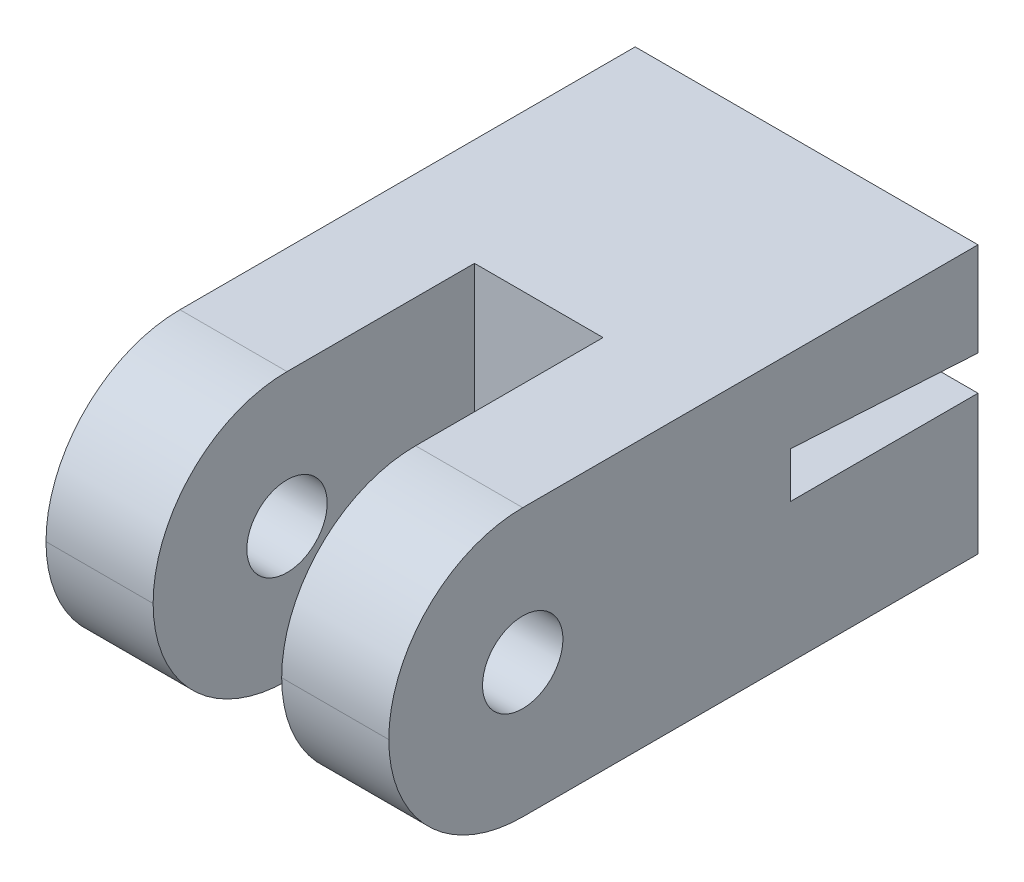
ISO-10303-21;
HEADER;
FILE_DESCRIPTION(('STEP AP214'),'2;1');
FILE_NAME('part.step','',(''),(''),'','','');
FILE_SCHEMA(('AUTOMOTIVE_DESIGN { 1 0 10303 214 1 1 1 1 }'));
ENDSEC;
DATA;
#1=APPLICATION_CONTEXT('core data for automotive mechanical design processes');
#2=APPLICATION_PROTOCOL_DEFINITION('international standard','automotive_design',2000,#1);
#3=PRODUCT_CONTEXT('',#1,'mechanical');
#4=PRODUCT('Part','Part','',(#3));
#5=PRODUCT_RELATED_PRODUCT_CATEGORY('part','',(#4));
#6=PRODUCT_DEFINITION_FORMATION('','',#4);
#7=PRODUCT_DEFINITION_CONTEXT('part definition',#1,'design');
#8=PRODUCT_DEFINITION('design','',#6,#7);
#9=PRODUCT_DEFINITION_SHAPE('','',#8);
#10=(LENGTH_UNIT() NAMED_UNIT(*) SI_UNIT(.MILLI.,.METRE.));
#11=(NAMED_UNIT(*) PLANE_ANGLE_UNIT() SI_UNIT($,.RADIAN.));
#12=(NAMED_UNIT(*) SI_UNIT($,.STERADIAN.) SOLID_ANGLE_UNIT());
#13=UNCERTAINTY_MEASURE_WITH_UNIT(LENGTH_MEASURE(1.E-05),#10,'distance_accuracy_value','');
#14=(GEOMETRIC_REPRESENTATION_CONTEXT(3) GLOBAL_UNCERTAINTY_ASSIGNED_CONTEXT((#13)) GLOBAL_UNIT_ASSIGNED_CONTEXT((#10,
#11,#12)) REPRESENTATION_CONTEXT('',''));
#15=CARTESIAN_POINT('',(0.,0.,0.));
#16=DIRECTION('',(0.,0.,1.));
#17=DIRECTION('',(1.,0.,0.));
#18=AXIS2_PLACEMENT_3D('',#15,#16,#17);
#19=CARTESIAN_POINT('',(0.,0.,10.));
#20=DIRECTION('',(0.,0.,1.));
#21=DIRECTION('',(1.,0.,0.));
#22=AXIS2_PLACEMENT_3D('',#19,#20,#21);
#23=PLANE('',#22);
#24=DIRECTION('',(1.,0.,0.));
#25=VECTOR('',#24,1.);
#26=CARTESIAN_POINT('',(0.,-4.,10.));
#27=LINE('',#26,#25);
#28=CARTESIAN_POINT('',(-2.4,-4.,10.));
#29=VERTEX_POINT('',#28);
#30=CARTESIAN_POINT('',(2.4,-4.,10.));
#31=VERTEX_POINT('',#30);
#32=EDGE_CURVE('E155',#29,#31,#27,.T.);
#33=ORIENTED_EDGE('',*,*,#32,.T.);
#34=DIRECTION('',(0.,-1.,0.));
#35=VECTOR('',#34,1.);
#36=CARTESIAN_POINT('',(2.4,-4.,10.));
#37=LINE('',#36,#35);
#38=CARTESIAN_POINT('',(2.4,6.,10.));
#39=VERTEX_POINT('',#38);
#40=EDGE_CURVE('E141',#39,#31,#37,.T.);
#41=ORIENTED_EDGE('',*,*,#40,.F.);
#42=DIRECTION('',(1.,0.,0.));
#43=VECTOR('',#42,1.);
#44=CARTESIAN_POINT('',(-6.4,6.,10.));
#45=LINE('',#44,#43);
#46=CARTESIAN_POINT('',(-2.4,6.,10.));
#47=VERTEX_POINT('',#46);
#48=EDGE_CURVE('E152',#47,#39,#45,.T.);
#49=ORIENTED_EDGE('',*,*,#48,.F.);
#50=DIRECTION('',(0.,1.,0.));
#51=VECTOR('',#50,1.);
#52=CARTESIAN_POINT('',(-2.4,-4.,10.));
#53=LINE('',#52,#51);
#54=EDGE_CURVE('E146',#29,#47,#53,.T.);
#55=ORIENTED_EDGE('',*,*,#54,.F.);
#56=EDGE_LOOP('',(#33,#41,#49,#55));
#57=FACE_BOUND('',#56,.T.);
#58=ADVANCED_FACE('F37',(#57),#23,.T.);
#59=CARTESIAN_POINT('',(-6.4,0.,10.));
#60=DIRECTION('',(1.,0.,0.));
#61=DIRECTION('',(0.,0.,-1.));
#62=AXIS2_PLACEMENT_3D('',#59,#60,#61);
#63=PLANE('',#62);
#64=CARTESIAN_POINT('',(-6.4,1.,17.));
#65=DIRECTION('',(-1.,0.,0.));
#66=DIRECTION('',(0.,0.,1.));
#67=AXIS2_PLACEMENT_3D('',#64,#65,#66);
#68=CIRCLE('',#67,1.50000000000001);
#69=CARTESIAN_POINT('',(-6.4,1.,18.5));
#70=VERTEX_POINT('',#69);
#71=EDGE_CURVE('E389',#70,#70,#68,.T.);
#72=ORIENTED_EDGE('',*,*,#71,.F.);
#73=EDGE_LOOP('',(#72));
#74=FACE_BOUND('',#73,.T.);
#75=DIRECTION('',(0.,0.,-1.));
#76=VECTOR('',#75,1.);
#77=CARTESIAN_POINT('',(-6.4,-4.,10.));
#78=LINE('',#77,#76);
#79=CARTESIAN_POINT('',(-6.4,-4.,17.));
#80=VERTEX_POINT('',#79);
#81=CARTESIAN_POINT('',(-6.4,-4.,0.));
#82=VERTEX_POINT('',#81);
#83=EDGE_CURVE('E219',#80,#82,#78,.T.);
#84=ORIENTED_EDGE('',*,*,#83,.F.);
#85=CARTESIAN_POINT('',(-6.4,1.,17.));
#86=DIRECTION('',(1.,0.,0.));
#87=DIRECTION('',(0.,0.,-1.));
#88=AXIS2_PLACEMENT_3D('',#85,#86,#87);
#89=CIRCLE('',#88,5.);
#90=CARTESIAN_POINT('',(-6.4,1.,22.));
#91=VERTEX_POINT('',#90);
#92=EDGE_CURVE('E242',#80,#91,#89,.F.);
#93=ORIENTED_EDGE('',*,*,#92,.T.);
#94=CARTESIAN_POINT('',(-6.4,1.,17.));
#95=DIRECTION('',(1.,0.,0.));
#96=DIRECTION('',(0.,0.,-1.));
#97=AXIS2_PLACEMENT_3D('',#94,#95,#96);
#98=CIRCLE('',#97,5.);
#99=CARTESIAN_POINT('',(-6.4,6.,17.));
#100=VERTEX_POINT('',#99);
#101=EDGE_CURVE('E240',#91,#100,#98,.F.);
#102=ORIENTED_EDGE('',*,*,#101,.T.);
#103=DIRECTION('',(0.,0.,1.));
#104=VECTOR('',#103,1.);
#105=CARTESIAN_POINT('',(-6.4,6.,0.));
#106=LINE('',#105,#104);
#107=CARTESIAN_POINT('',(-6.4,6.,0.));
#108=VERTEX_POINT('',#107);
#109=EDGE_CURVE('E163',#108,#100,#106,.T.);
#110=ORIENTED_EDGE('',*,*,#109,.F.);
#111=DIRECTION('',(0.,-1.,0.));
#112=VECTOR('',#111,1.);
#113=CARTESIAN_POINT('',(-6.4,0.,0.));
#114=LINE('',#113,#112);
#115=CARTESIAN_POINT('',(-6.4,2.5,0.));
#116=VERTEX_POINT('',#115);
#117=EDGE_CURVE('E208',#108,#116,#114,.T.);
#118=ORIENTED_EDGE('',*,*,#117,.T.);
#119=DIRECTION('',(0.,0.0574409581039475,0.998348905108881));
#120=VECTOR('',#119,1.);
#121=CARTESIAN_POINT('',(-6.4,3.06521251714506,9.8236400692423));
#122=LINE('',#121,#120);
#123=CARTESIAN_POINT('',(-6.4,2.90275168798205,7.));
#124=VERTEX_POINT('',#123);
#125=EDGE_CURVE('E186',#116,#124,#122,.T.);
#126=ORIENTED_EDGE('',*,*,#125,.T.);
#127=DIRECTION('',(0.,-1.,0.));
#128=VECTOR('',#127,1.);
#129=CARTESIAN_POINT('',(-6.4,0.,7.));
#130=LINE('',#129,#128);
#131=CARTESIAN_POINT('',(-6.4,1.2,7.));
#132=VERTEX_POINT('',#131);
#133=EDGE_CURVE('E190',#124,#132,#130,.T.);
#134=ORIENTED_EDGE('',*,*,#133,.T.);
#135=DIRECTION('',(0.,0.,-1.));
#136=VECTOR('',#135,1.);
#137=CARTESIAN_POINT('',(-6.4,1.2,7.));
#138=LINE('',#137,#136);
#139=CARTESIAN_POINT('',(-6.4,1.2,0.));
#140=VERTEX_POINT('',#139);
#141=EDGE_CURVE('E203',#132,#140,#138,.T.);
#142=ORIENTED_EDGE('',*,*,#141,.T.);
#143=EDGE_CURVE('E205',#140,#82,#114,.T.);
#144=ORIENTED_EDGE('',*,*,#143,.T.);
#145=EDGE_LOOP('',(#84,#93,#102,#110,#118,#126,#134,#142,#144));
#146=FACE_BOUND('',#145,.T.);
#147=ADVANCED_FACE('F284',(#74,#146),#63,.F.);
#148=CARTESIAN_POINT('',(6.4,0.,10.));
#149=DIRECTION('',(-1.,0.,0.));
#150=DIRECTION('',(0.,0.,1.));
#151=AXIS2_PLACEMENT_3D('',#148,#149,#150);
#152=PLANE('',#151);
#153=CARTESIAN_POINT('',(6.4,1.,17.));
#154=DIRECTION('',(-1.,0.,0.));
#155=DIRECTION('',(0.,0.,1.));
#156=AXIS2_PLACEMENT_3D('',#153,#154,#155);
#157=CIRCLE('',#156,1.50000000000001);
#158=CARTESIAN_POINT('',(6.4,1.,18.5));
#159=VERTEX_POINT('',#158);
#160=EDGE_CURVE('E259',#159,#159,#157,.T.);
#161=ORIENTED_EDGE('',*,*,#160,.T.);
#162=EDGE_LOOP('',(#161));
#163=FACE_BOUND('',#162,.T.);
#164=CARTESIAN_POINT('',(6.4,1.,17.));
#165=DIRECTION('',(-1.,0.,0.));
#166=DIRECTION('',(0.,0.,1.));
#167=AXIS2_PLACEMENT_3D('',#164,#165,#166);
#168=CIRCLE('',#167,5.);
#169=CARTESIAN_POINT('',(6.4,6.,17.));
#170=VERTEX_POINT('',#169);
#171=CARTESIAN_POINT('',(6.4,1.,22.));
#172=VERTEX_POINT('',#171);
#173=EDGE_CURVE('E60',#170,#172,#168,.F.);
#174=ORIENTED_EDGE('',*,*,#173,.T.);
#175=CARTESIAN_POINT('',(6.4,1.,17.));
#176=DIRECTION('',(-1.,0.,0.));
#177=DIRECTION('',(0.,0.,1.));
#178=AXIS2_PLACEMENT_3D('',#175,#176,#177);
#179=CIRCLE('',#178,5.);
#180=CARTESIAN_POINT('',(6.4,-4.,17.));
#181=VERTEX_POINT('',#180);
#182=EDGE_CURVE('E249',#172,#181,#179,.F.);
#183=ORIENTED_EDGE('',*,*,#182,.T.);
#184=DIRECTION('',(0.,0.,-1.));
#185=VECTOR('',#184,1.);
#186=CARTESIAN_POINT('',(6.4,-4.,10.));
#187=LINE('',#186,#185);
#188=CARTESIAN_POINT('',(6.4,-4.,0.));
#189=VERTEX_POINT('',#188);
#190=EDGE_CURVE('E218',#181,#189,#187,.T.);
#191=ORIENTED_EDGE('',*,*,#190,.T.);
#192=DIRECTION('',(0.,1.,0.));
#193=VECTOR('',#192,1.);
#194=CARTESIAN_POINT('',(6.4,0.,0.));
#195=LINE('',#194,#193);
#196=CARTESIAN_POINT('',(6.4,1.2,0.));
#197=VERTEX_POINT('',#196);
#198=EDGE_CURVE('E215',#189,#197,#195,.T.);
#199=ORIENTED_EDGE('',*,*,#198,.T.);
#200=DIRECTION('',(0.,0.,-1.));
#201=VECTOR('',#200,1.);
#202=CARTESIAN_POINT('',(6.4,1.2,7.));
#203=LINE('',#202,#201);
#204=CARTESIAN_POINT('',(6.4,1.2,7.));
#205=VERTEX_POINT('',#204);
#206=EDGE_CURVE('E198',#205,#197,#203,.T.);
#207=ORIENTED_EDGE('',*,*,#206,.F.);
#208=DIRECTION('',(0.,1.,0.));
#209=VECTOR('',#208,1.);
#210=CARTESIAN_POINT('',(6.4,0.,7.));
#211=LINE('',#210,#209);
#212=CARTESIAN_POINT('',(6.4,2.90275168798205,7.));
#213=VERTEX_POINT('',#212);
#214=EDGE_CURVE('E196',#205,#213,#211,.T.);
#215=ORIENTED_EDGE('',*,*,#214,.T.);
#216=DIRECTION('',(0.,0.0574409581039475,0.998348905108881));
#217=VECTOR('',#216,1.);
#218=CARTESIAN_POINT('',(6.4,2.5,0.));
#219=LINE('',#218,#217);
#220=CARTESIAN_POINT('',(6.4,2.5,0.));
#221=VERTEX_POINT('',#220);
#222=EDGE_CURVE('E180',#221,#213,#219,.T.);
#223=ORIENTED_EDGE('',*,*,#222,.F.);
#224=CARTESIAN_POINT('',(6.4,6.,0.));
#225=VERTEX_POINT('',#224);
#226=EDGE_CURVE('E214',#221,#225,#195,.T.);
#227=ORIENTED_EDGE('',*,*,#226,.T.);
#228=DIRECTION('',(0.,0.,-1.));
#229=VECTOR('',#228,1.);
#230=CARTESIAN_POINT('',(6.4,6.,0.));
#231=LINE('',#230,#229);
#232=EDGE_CURVE('E162',#170,#225,#231,.T.);
#233=ORIENTED_EDGE('',*,*,#232,.F.);
#234=EDGE_LOOP('',(#174,#183,#191,#199,#207,#215,#223,#227,#233));
#235=FACE_BOUND('',#234,.T.);
#236=ADVANCED_FACE('F273',(#163,#235),#152,.F.);
#237=CARTESIAN_POINT('',(0.,0.,0.));
#238=DIRECTION('',(0.,0.,1.));
#239=DIRECTION('',(1.,0.,0.));
#240=AXIS2_PLACEMENT_3D('',#237,#238,#239);
#241=PLANE('',#240);
#242=DIRECTION('',(1.,0.,0.));
#243=VECTOR('',#242,1.);
#244=CARTESIAN_POINT('',(0.,1.2,0.));
#245=LINE('',#244,#243);
#246=EDGE_CURVE('E189',#140,#197,#245,.T.);
#247=ORIENTED_EDGE('',*,*,#246,.T.);
#248=ORIENTED_EDGE('',*,*,#198,.F.);
#249=DIRECTION('',(1.,0.,0.));
#250=VECTOR('',#249,1.);
#251=CARTESIAN_POINT('',(0.,-4.,0.));
#252=LINE('',#251,#250);
#253=EDGE_CURVE('E211',#82,#189,#252,.T.);
#254=ORIENTED_EDGE('',*,*,#253,.F.);
#255=ORIENTED_EDGE('',*,*,#143,.F.);
#256=EDGE_LOOP('',(#247,#248,#254,#255));
#257=FACE_BOUND('',#256,.T.);
#258=ADVANCED_FACE('F279',(#257),#241,.F.);
#259=CARTESIAN_POINT('',(0.,-4.,10.));
#260=DIRECTION('',(0.,1.,0.));
#261=DIRECTION('',(0.,0.,1.));
#262=AXIS2_PLACEMENT_3D('',#259,#260,#261);
#263=PLANE('',#262);
#264=DIRECTION('',(0.,0.,-1.));
#265=VECTOR('',#264,1.);
#266=CARTESIAN_POINT('',(-2.4,-4.,22.));
#267=LINE('',#266,#265);
#268=CARTESIAN_POINT('',(-2.4,-4.,17.));
#269=VERTEX_POINT('',#268);
#270=EDGE_CURVE('E167',#269,#29,#267,.T.);
#271=ORIENTED_EDGE('',*,*,#270,.F.);
#272=DIRECTION('',(1.,0.,0.));
#273=VECTOR('',#272,1.);
#274=CARTESIAN_POINT('',(0.,-4.,17.));
#275=LINE('',#274,#273);
#276=EDGE_CURVE('E238',#269,#80,#275,.F.);
#277=ORIENTED_EDGE('',*,*,#276,.T.);
#278=ORIENTED_EDGE('',*,*,#83,.T.);
#279=ORIENTED_EDGE('',*,*,#253,.T.);
#280=ORIENTED_EDGE('',*,*,#190,.F.);
#281=DIRECTION('',(1.,0.,0.));
#282=VECTOR('',#281,1.);
#283=CARTESIAN_POINT('',(2.4,-4.,17.));
#284=LINE('',#283,#282);
#285=CARTESIAN_POINT('',(2.4,-4.,17.));
#286=VERTEX_POINT('',#285);
#287=EDGE_CURVE('E230',#181,#286,#284,.F.);
#288=ORIENTED_EDGE('',*,*,#287,.T.);
#289=DIRECTION('',(0.,0.,-1.));
#290=VECTOR('',#289,1.);
#291=CARTESIAN_POINT('',(2.4,-4.,22.));
#292=LINE('',#291,#290);
#293=EDGE_CURVE('E147',#286,#31,#292,.T.);
#294=ORIENTED_EDGE('',*,*,#293,.T.);
#295=ORIENTED_EDGE('',*,*,#32,.F.);
#296=EDGE_LOOP('',(#271,#277,#278,#279,#280,#288,#294,#295));
#297=FACE_BOUND('',#296,.T.);
#298=ADVANCED_FACE('F269',(#297),#263,.F.);
#299=ORIENTED_EDGE('',*,*,#226,.F.);
#300=DIRECTION('',(1.,0.,0.));
#301=VECTOR('',#300,1.);
#302=CARTESIAN_POINT('',(0.,2.5,0.));
#303=LINE('',#302,#301);
#304=EDGE_CURVE('E194',#116,#221,#303,.T.);
#305=ORIENTED_EDGE('',*,*,#304,.F.);
#306=ORIENTED_EDGE('',*,*,#117,.F.);
#307=DIRECTION('',(-1.,0.,0.));
#308=VECTOR('',#307,1.);
#309=CARTESIAN_POINT('',(-6.4,6.,0.));
#310=LINE('',#309,#308);
#311=EDGE_CURVE('E165',#225,#108,#310,.T.);
#312=ORIENTED_EDGE('',*,*,#311,.F.);
#313=EDGE_LOOP('',(#299,#305,#306,#312));
#314=FACE_BOUND('',#313,.T.);
#315=ADVANCED_FACE('F297',(#314),#241,.F.);
#316=CARTESIAN_POINT('',(0.,1.2,7.));
#317=DIRECTION('',(0.,1.,0.));
#318=DIRECTION('',(0.,0.,1.));
#319=AXIS2_PLACEMENT_3D('',#316,#317,#318);
#320=PLANE('',#319);
#321=ORIENTED_EDGE('',*,*,#246,.F.);
#322=ORIENTED_EDGE('',*,*,#141,.F.);
#323=DIRECTION('',(1.,0.,0.));
#324=VECTOR('',#323,1.);
#325=CARTESIAN_POINT('',(0.,1.2,7.));
#326=LINE('',#325,#324);
#327=EDGE_CURVE('E193',#132,#205,#326,.T.);
#328=ORIENTED_EDGE('',*,*,#327,.T.);
#329=ORIENTED_EDGE('',*,*,#206,.T.);
#330=EDGE_LOOP('',(#321,#322,#328,#329));
#331=FACE_BOUND('',#330,.T.);
#332=ADVANCED_FACE('F282',(#331),#320,.T.);
#333=CARTESIAN_POINT('',(0.,0.,7.));
#334=DIRECTION('',(0.,0.,1.));
#335=DIRECTION('',(1.,0.,0.));
#336=AXIS2_PLACEMENT_3D('',#333,#334,#335);
#337=PLANE('',#336);
#338=ORIENTED_EDGE('',*,*,#133,.F.);
#339=DIRECTION('',(1.,0.,0.));
#340=VECTOR('',#339,1.);
#341=CARTESIAN_POINT('',(-8.6,2.90275168798205,7.));
#342=LINE('',#341,#340);
#343=EDGE_CURVE('E183',#124,#213,#342,.T.);
#344=ORIENTED_EDGE('',*,*,#343,.T.);
#345=ORIENTED_EDGE('',*,*,#214,.F.);
#346=ORIENTED_EDGE('',*,*,#327,.F.);
#347=EDGE_LOOP('',(#338,#344,#345,#346));
#348=FACE_BOUND('',#347,.T.);
#349=ADVANCED_FACE('F287',(#348),#337,.F.);
#350=CARTESIAN_POINT('',(-8.6,2.5,0.));
#351=DIRECTION('',(0.,0.998348905108881,-0.0574409581039475));
#352=DIRECTION('',(0.,0.0574409581039475,0.998348905108881));
#353=AXIS2_PLACEMENT_3D('',#350,#351,#352);
#354=PLANE('',#353);
#355=ORIENTED_EDGE('',*,*,#304,.T.);
#356=ORIENTED_EDGE('',*,*,#222,.T.);
#357=ORIENTED_EDGE('',*,*,#343,.F.);
#358=ORIENTED_EDGE('',*,*,#125,.F.);
#359=EDGE_LOOP('',(#355,#356,#357,#358));
#360=FACE_BOUND('',#359,.T.);
#361=ADVANCED_FACE('F290',(#360),#354,.F.);
#362=CARTESIAN_POINT('',(0.,6.,0.));
#363=DIRECTION('',(0.,1.,0.));
#364=DIRECTION('',(0.,0.,1.));
#365=AXIS2_PLACEMENT_3D('',#362,#363,#364);
#366=PLANE('',#365);
#367=ORIENTED_EDGE('',*,*,#109,.T.);
#368=DIRECTION('',(-1.,0.,0.));
#369=VECTOR('',#368,1.);
#370=CARTESIAN_POINT('',(-2.4,6.,17.));
#371=LINE('',#370,#369);
#372=CARTESIAN_POINT('',(-2.4,6.,17.));
#373=VERTEX_POINT('',#372);
#374=EDGE_CURVE('E246',#100,#373,#371,.F.);
#375=ORIENTED_EDGE('',*,*,#374,.T.);
#376=DIRECTION('',(0.,0.,-1.));
#377=VECTOR('',#376,1.);
#378=CARTESIAN_POINT('',(-2.4,6.,22.));
#379=LINE('',#378,#377);
#380=EDGE_CURVE('E161',#373,#47,#379,.T.);
#381=ORIENTED_EDGE('',*,*,#380,.T.);
#382=ORIENTED_EDGE('',*,*,#48,.T.);
#383=DIRECTION('',(0.,0.,-1.));
#384=VECTOR('',#383,1.);
#385=CARTESIAN_POINT('',(2.4,6.,22.));
#386=LINE('',#385,#384);
#387=CARTESIAN_POINT('',(2.4,6.,17.));
#388=VERTEX_POINT('',#387);
#389=EDGE_CURVE('E138',#388,#39,#386,.T.);
#390=ORIENTED_EDGE('',*,*,#389,.F.);
#391=DIRECTION('',(-1.,0.,0.));
#392=VECTOR('',#391,1.);
#393=CARTESIAN_POINT('',(0.,6.,17.));
#394=LINE('',#393,#392);
#395=EDGE_CURVE('E244',#388,#170,#394,.F.);
#396=ORIENTED_EDGE('',*,*,#395,.T.);
#397=ORIENTED_EDGE('',*,*,#232,.T.);
#398=ORIENTED_EDGE('',*,*,#311,.T.);
#399=EDGE_LOOP('',(#367,#375,#381,#382,#390,#396,#397,#398));
#400=FACE_BOUND('',#399,.T.);
#401=ADVANCED_FACE('F159',(#400),#366,.T.);
#402=CARTESIAN_POINT('',(-2.4,-4.,22.));
#403=DIRECTION('',(-1.,0.,0.));
#404=DIRECTION('',(0.,0.,1.));
#405=AXIS2_PLACEMENT_3D('',#402,#403,#404);
#406=PLANE('',#405);
#407=CARTESIAN_POINT('',(-2.4,1.,17.));
#408=DIRECTION('',(-1.,0.,0.));
#409=DIRECTION('',(0.,0.,1.));
#410=AXIS2_PLACEMENT_3D('',#407,#408,#409);
#411=CIRCLE('',#410,1.50000000000001);
#412=CARTESIAN_POINT('',(-2.4,1.,18.5));
#413=VERTEX_POINT('',#412);
#414=EDGE_CURVE('E255',#413,#413,#411,.T.);
#415=ORIENTED_EDGE('',*,*,#414,.T.);
#416=EDGE_LOOP('',(#415));
#417=FACE_BOUND('',#416,.T.);
#418=CARTESIAN_POINT('',(-2.4,1.,17.));
#419=DIRECTION('',(-1.,0.,0.));
#420=DIRECTION('',(0.,0.,1.));
#421=AXIS2_PLACEMENT_3D('',#418,#419,#420);
#422=CIRCLE('',#421,5.);
#423=CARTESIAN_POINT('',(-2.4,1.,22.));
#424=VERTEX_POINT('',#423);
#425=EDGE_CURVE('E220',#373,#424,#422,.F.);
#426=ORIENTED_EDGE('',*,*,#425,.T.);
#427=CARTESIAN_POINT('',(-2.4,1.,17.));
#428=DIRECTION('',(-1.,0.,0.));
#429=DIRECTION('',(0.,0.,1.));
#430=AXIS2_PLACEMENT_3D('',#427,#428,#429);
#431=CIRCLE('',#430,5.);
#432=EDGE_CURVE('E225',#424,#269,#431,.F.);
#433=ORIENTED_EDGE('',*,*,#432,.T.);
#434=ORIENTED_EDGE('',*,*,#270,.T.);
#435=ORIENTED_EDGE('',*,*,#54,.T.);
#436=ORIENTED_EDGE('',*,*,#380,.F.);
#437=EDGE_LOOP('',(#426,#433,#434,#435,#436));
#438=FACE_BOUND('',#437,.T.);
#439=ADVANCED_FACE('F307',(#417,#438),#406,.F.);
#440=CARTESIAN_POINT('',(2.4,-4.,22.));
#441=DIRECTION('',(1.,0.,0.));
#442=DIRECTION('',(0.,0.,-1.));
#443=AXIS2_PLACEMENT_3D('',#440,#441,#442);
#444=PLANE('',#443);
#445=CARTESIAN_POINT('',(2.4,1.,17.));
#446=DIRECTION('',(1.,0.,0.));
#447=DIRECTION('',(0.,0.,-1.));
#448=AXIS2_PLACEMENT_3D('',#445,#446,#447);
#449=CIRCLE('',#448,1.50000000000001);
#450=CARTESIAN_POINT('',(2.4,1.,15.5));
#451=VERTEX_POINT('',#450);
#452=EDGE_CURVE('E41',#451,#451,#449,.T.);
#453=ORIENTED_EDGE('',*,*,#452,.T.);
#454=EDGE_LOOP('',(#453));
#455=FACE_BOUND('',#454,.T.);
#456=ORIENTED_EDGE('',*,*,#293,.F.);
#457=CARTESIAN_POINT('',(2.4,1.,17.));
#458=DIRECTION('',(1.,0.,0.));
#459=DIRECTION('',(0.,0.,-1.));
#460=AXIS2_PLACEMENT_3D('',#457,#458,#459);
#461=CIRCLE('',#460,5.);
#462=CARTESIAN_POINT('',(2.4,1.,22.));
#463=VERTEX_POINT('',#462);
#464=EDGE_CURVE('E11',#286,#463,#461,.F.);
#465=ORIENTED_EDGE('',*,*,#464,.T.);
#466=CARTESIAN_POINT('',(2.4,1.,17.));
#467=DIRECTION('',(1.,0.,0.));
#468=DIRECTION('',(0.,0.,-1.));
#469=AXIS2_PLACEMENT_3D('',#466,#467,#468);
#470=CIRCLE('',#469,5.);
#471=EDGE_CURVE('E46',#463,#388,#470,.F.);
#472=ORIENTED_EDGE('',*,*,#471,.T.);
#473=ORIENTED_EDGE('',*,*,#389,.T.);
#474=ORIENTED_EDGE('',*,*,#40,.T.);
#475=EDGE_LOOP('',(#456,#465,#472,#473,#474));
#476=FACE_BOUND('',#475,.T.);
#477=ADVANCED_FACE('F140',(#455,#476),#444,.F.);
#478=CARTESIAN_POINT('',(0.,1.,17.));
#479=DIRECTION('',(1.,0.,0.));
#480=DIRECTION('',(0.,0.,-1.));
#481=AXIS2_PLACEMENT_3D('',#478,#479,#480);
#482=CYLINDRICAL_SURFACE('',#481,5.);
#483=ORIENTED_EDGE('',*,*,#374,.F.);
#484=ORIENTED_EDGE('',*,*,#101,.F.);
#485=DIRECTION('',(-1.,0.,0.));
#486=VECTOR('',#485,1.);
#487=CARTESIAN_POINT('',(-6.4,1.,22.));
#488=LINE('',#487,#486);
#489=EDGE_CURVE('E156',#424,#91,#488,.T.);
#490=ORIENTED_EDGE('',*,*,#489,.F.);
#491=ORIENTED_EDGE('',*,*,#425,.F.);
#492=EDGE_LOOP('',(#483,#484,#490,#491));
#493=FACE_BOUND('',#492,.T.);
#494=ADVANCED_FACE('F302',(#493),#482,.T.);
#495=CARTESIAN_POINT('',(0.,1.,17.));
#496=DIRECTION('',(1.,0.,0.));
#497=DIRECTION('',(0.,0.,-1.));
#498=AXIS2_PLACEMENT_3D('',#495,#496,#497);
#499=CYLINDRICAL_SURFACE('',#498,5.);
#500=ORIENTED_EDGE('',*,*,#92,.F.);
#501=ORIENTED_EDGE('',*,*,#276,.F.);
#502=ORIENTED_EDGE('',*,*,#432,.F.);
#503=ORIENTED_EDGE('',*,*,#489,.T.);
#504=EDGE_LOOP('',(#500,#501,#502,#503));
#505=FACE_BOUND('',#504,.T.);
#506=ADVANCED_FACE('F305',(#505),#499,.T.);
#507=CARTESIAN_POINT('',(0.,1.,17.));
#508=DIRECTION('',(-1.,0.,0.));
#509=DIRECTION('',(0.,0.,1.));
#510=AXIS2_PLACEMENT_3D('',#507,#508,#509);
#511=CYLINDRICAL_SURFACE('',#510,5.);
#512=ORIENTED_EDGE('',*,*,#395,.F.);
#513=ORIENTED_EDGE('',*,*,#471,.F.);
#514=DIRECTION('',(-1.,0.,0.));
#515=VECTOR('',#514,1.);
#516=CARTESIAN_POINT('',(0.,1.,22.));
#517=LINE('',#516,#515);
#518=EDGE_CURVE('E253',#172,#463,#517,.T.);
#519=ORIENTED_EDGE('',*,*,#518,.F.);
#520=ORIENTED_EDGE('',*,*,#173,.F.);
#521=EDGE_LOOP('',(#512,#513,#519,#520));
#522=FACE_BOUND('',#521,.T.);
#523=ADVANCED_FACE('F39',(#522),#511,.T.);
#524=CARTESIAN_POINT('',(0.,1.,17.));
#525=DIRECTION('',(-1.,0.,0.));
#526=DIRECTION('',(0.,0.,1.));
#527=AXIS2_PLACEMENT_3D('',#524,#525,#526);
#528=CYLINDRICAL_SURFACE('',#527,5.);
#529=ORIENTED_EDGE('',*,*,#464,.F.);
#530=ORIENTED_EDGE('',*,*,#287,.F.);
#531=ORIENTED_EDGE('',*,*,#182,.F.);
#532=ORIENTED_EDGE('',*,*,#518,.T.);
#533=EDGE_LOOP('',(#529,#530,#531,#532));
#534=FACE_BOUND('',#533,.T.);
#535=ADVANCED_FACE('F272',(#534),#528,.T.);
#536=CARTESIAN_POINT('',(-6.4,1.,17.));
#537=DIRECTION('',(-1.,0.,0.));
#538=DIRECTION('',(0.,0.,1.));
#539=AXIS2_PLACEMENT_3D('',#536,#537,#538);
#540=CYLINDRICAL_SURFACE('',#539,1.50000000000001);
#541=ORIENTED_EDGE('',*,*,#452,.F.);
#542=EDGE_LOOP('',(#541));
#543=FACE_BOUND('',#542,.T.);
#544=ORIENTED_EDGE('',*,*,#160,.F.);
#545=EDGE_LOOP('',(#544));
#546=FACE_BOUND('',#545,.T.);
#547=ADVANCED_FACE('F340',(#543,#546),#540,.F.);
#548=ORIENTED_EDGE('',*,*,#71,.T.);
#549=EDGE_LOOP('',(#548));
#550=FACE_BOUND('',#549,.T.);
#551=ORIENTED_EDGE('',*,*,#414,.F.);
#552=EDGE_LOOP('',(#551));
#553=FACE_BOUND('',#552,.T.);
#554=ADVANCED_FACE('F345',(#550,#553),#540,.F.);
#555=CLOSED_SHELL('',(#58,#147,#236,#258,#298,#315,#332,#349,#361,#401,#439,#477,#494,#506,#523,
#535,#547,#554));
#556=MANIFOLD_SOLID_BREP('B2',#555);
#557=ADVANCED_BREP_SHAPE_REPRESENTATION('',(#18,#556),#14);
#558=SHAPE_DEFINITION_REPRESENTATION(#9,#557);
ENDSEC;
END-ISO-10303-21;
